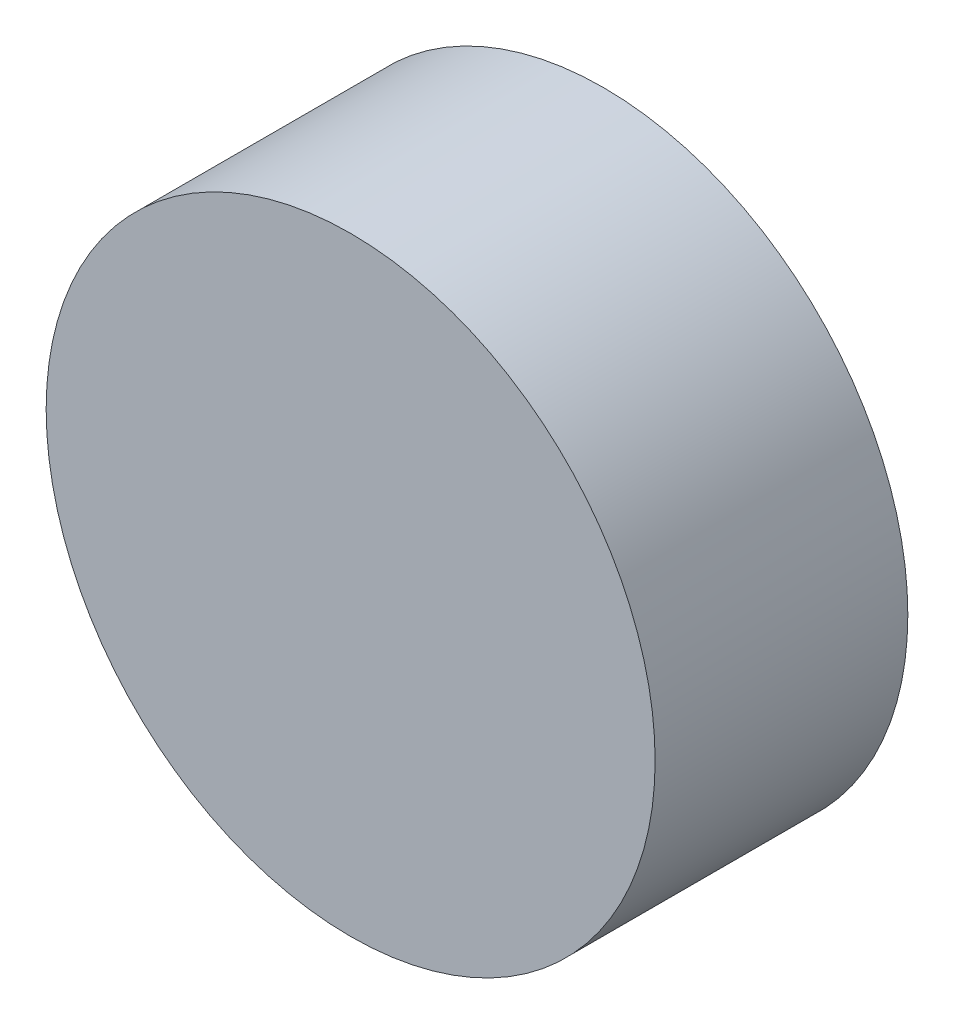
ISO-10303-21;
HEADER;
FILE_DESCRIPTION(('STEP AP214'),'2;1');
FILE_NAME('part.step','',(''),(''),'','','');
FILE_SCHEMA(('AUTOMOTIVE_DESIGN { 1 0 10303 214 1 1 1 1 }'));
ENDSEC;
DATA;
#1=APPLICATION_CONTEXT('core data for automotive mechanical design processes');
#2=APPLICATION_PROTOCOL_DEFINITION('international standard','automotive_design',2000,#1);
#3=PRODUCT_CONTEXT('',#1,'mechanical');
#4=PRODUCT('Part','Part','',(#3));
#5=PRODUCT_RELATED_PRODUCT_CATEGORY('part','',(#4));
#6=PRODUCT_DEFINITION_FORMATION('','',#4);
#7=PRODUCT_DEFINITION_CONTEXT('part definition',#1,'design');
#8=PRODUCT_DEFINITION('design','',#6,#7);
#9=PRODUCT_DEFINITION_SHAPE('','',#8);
#10=(LENGTH_UNIT() NAMED_UNIT(*) SI_UNIT(.MILLI.,.METRE.));
#11=(NAMED_UNIT(*) PLANE_ANGLE_UNIT() SI_UNIT($,.RADIAN.));
#12=(NAMED_UNIT(*) SI_UNIT($,.STERADIAN.) SOLID_ANGLE_UNIT());
#13=UNCERTAINTY_MEASURE_WITH_UNIT(LENGTH_MEASURE(1.E-05),#10,'distance_accuracy_value','');
#14=(GEOMETRIC_REPRESENTATION_CONTEXT(3) GLOBAL_UNCERTAINTY_ASSIGNED_CONTEXT((#13)) GLOBAL_UNIT_ASSIGNED_CONTEXT((#10,
#11,#12)) REPRESENTATION_CONTEXT('',''));
#15=CARTESIAN_POINT('',(0.,0.,0.));
#16=DIRECTION('',(0.,0.,1.));
#17=DIRECTION('',(1.,0.,0.));
#18=AXIS2_PLACEMENT_3D('',#15,#16,#17);
#19=CARTESIAN_POINT('',(0.,0.,-195.));
#20=DIRECTION('',(0.,0.,1.));
#21=DIRECTION('',(1.,0.,0.));
#22=AXIS2_PLACEMENT_3D('',#19,#20,#21);
#23=CYLINDRICAL_SURFACE('',#22,234.95);
#24=CARTESIAN_POINT('',(0.,0.,-195.));
#25=DIRECTION('',(0.,0.,1.));
#26=DIRECTION('',(1.,0.,0.));
#27=AXIS2_PLACEMENT_3D('',#24,#25,#26);
#28=CIRCLE('',#27,234.95);
#29=CARTESIAN_POINT('',(234.95,0.,-195.));
#30=VERTEX_POINT('',#29);
#31=EDGE_CURVE('E10',#30,#30,#28,.T.);
#32=ORIENTED_EDGE('',*,*,#31,.T.);
#33=EDGE_LOOP('',(#32));
#34=FACE_BOUND('',#33,.T.);
#35=CARTESIAN_POINT('',(0.,0.,0.));
#36=DIRECTION('',(0.,0.,1.));
#37=DIRECTION('',(1.,0.,0.));
#38=AXIS2_PLACEMENT_3D('',#35,#36,#37);
#39=CIRCLE('',#38,234.95);
#40=CARTESIAN_POINT('',(234.95,0.,0.));
#41=VERTEX_POINT('',#40);
#42=EDGE_CURVE('E34',#41,#41,#39,.T.);
#43=ORIENTED_EDGE('',*,*,#42,.F.);
#44=EDGE_LOOP('',(#43));
#45=FACE_BOUND('',#44,.T.);
#46=ADVANCED_FACE('F31',(#34,#45),#23,.T.);
#47=CARTESIAN_POINT('',(0.,0.,-195.));
#48=DIRECTION('',(0.,0.,1.));
#49=DIRECTION('',(1.,0.,0.));
#50=AXIS2_PLACEMENT_3D('',#47,#48,#49);
#51=PLANE('',#50);
#52=ORIENTED_EDGE('',*,*,#31,.F.);
#53=EDGE_LOOP('',(#52));
#54=FACE_BOUND('',#53,.T.);
#55=ADVANCED_FACE('F46',(#54),#51,.F.);
#56=CARTESIAN_POINT('',(0.,0.,0.));
#57=DIRECTION('',(0.,0.,1.));
#58=DIRECTION('',(1.,0.,0.));
#59=AXIS2_PLACEMENT_3D('',#56,#57,#58);
#60=PLANE('',#59);
#61=ORIENTED_EDGE('',*,*,#42,.T.);
#62=EDGE_LOOP('',(#61));
#63=FACE_BOUND('',#62,.T.);
#64=ADVANCED_FACE('F43',(#63),#60,.T.);
#65=CLOSED_SHELL('',(#46,#55,#64));
#66=MANIFOLD_SOLID_BREP('B2',#65);
#67=ADVANCED_BREP_SHAPE_REPRESENTATION('',(#18,#66),#14);
#68=SHAPE_DEFINITION_REPRESENTATION(#9,#67);
ENDSEC;
END-ISO-10303-21;
